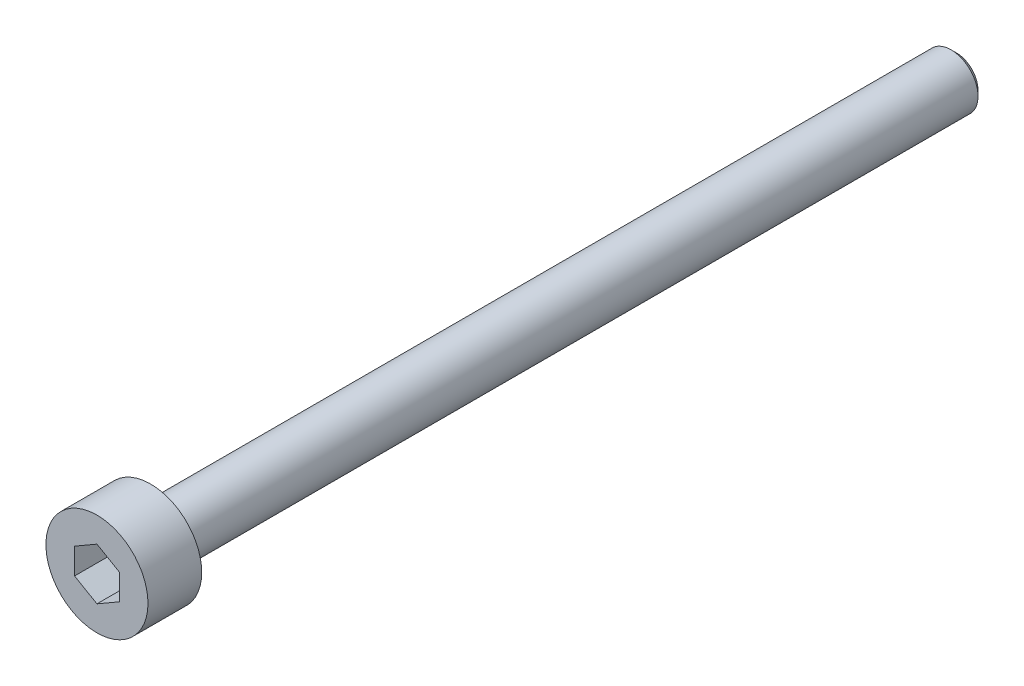
ISO-10303-21;
HEADER;
FILE_DESCRIPTION(('STEP AP214'),'2;1');
FILE_NAME('part.step','',(''),(''),'','','');
FILE_SCHEMA(('AUTOMOTIVE_DESIGN { 1 0 10303 214 1 1 1 1 }'));
ENDSEC;
DATA;
#1=APPLICATION_CONTEXT('core data for automotive mechanical design processes');
#2=APPLICATION_PROTOCOL_DEFINITION('international standard','automotive_design',2000,#1);
#3=PRODUCT_CONTEXT('',#1,'mechanical');
#4=PRODUCT('Part','Part','',(#3));
#5=PRODUCT_RELATED_PRODUCT_CATEGORY('part','',(#4));
#6=PRODUCT_DEFINITION_FORMATION('','',#4);
#7=PRODUCT_DEFINITION_CONTEXT('part definition',#1,'design');
#8=PRODUCT_DEFINITION('design','',#6,#7);
#9=PRODUCT_DEFINITION_SHAPE('','',#8);
#10=(LENGTH_UNIT() NAMED_UNIT(*) SI_UNIT(.MILLI.,.METRE.));
#11=(NAMED_UNIT(*) PLANE_ANGLE_UNIT() SI_UNIT($,.RADIAN.));
#12=(NAMED_UNIT(*) SI_UNIT($,.STERADIAN.) SOLID_ANGLE_UNIT());
#13=UNCERTAINTY_MEASURE_WITH_UNIT(LENGTH_MEASURE(1.E-05),#10,'distance_accuracy_value','');
#14=(GEOMETRIC_REPRESENTATION_CONTEXT(3) GLOBAL_UNCERTAINTY_ASSIGNED_CONTEXT((#13)) GLOBAL_UNIT_ASSIGNED_CONTEXT((#10,
#11,#12)) REPRESENTATION_CONTEXT('',''));
#15=CARTESIAN_POINT('',(0.,0.,0.));
#16=DIRECTION('',(0.,0.,1.));
#17=DIRECTION('',(1.,0.,0.));
#18=AXIS2_PLACEMENT_3D('',#15,#16,#17);
#19=CARTESIAN_POINT('',(0.,0.,0.));
#20=DIRECTION('',(0.,0.,1.));
#21=DIRECTION('',(1.,0.,0.));
#22=AXIS2_PLACEMENT_3D('',#19,#20,#21);
#23=PLANE('',#22);
#24=CARTESIAN_POINT('',(0.,0.,0.));
#25=DIRECTION('',(0.,0.,1.));
#26=DIRECTION('',(1.,0.,0.));
#27=AXIS2_PLACEMENT_3D('',#24,#25,#26);
#28=CIRCLE('',#27,2.85);
#29=CARTESIAN_POINT('',(2.85,0.,0.));
#30=VERTEX_POINT('',#29);
#31=EDGE_CURVE('E137',#30,#30,#28,.T.);
#32=ORIENTED_EDGE('',*,*,#31,.F.);
#33=EDGE_LOOP('',(#32));
#34=FACE_BOUND('',#33,.T.);
#35=CARTESIAN_POINT('',(0.,0.,0.));
#36=DIRECTION('',(0.,0.,1.));
#37=DIRECTION('',(1.,0.,0.));
#38=AXIS2_PLACEMENT_3D('',#35,#36,#37);
#39=CIRCLE('',#38,1.5);
#40=CARTESIAN_POINT('',(1.5,0.,0.));
#41=VERTEX_POINT('',#40);
#42=EDGE_CURVE('E146',#41,#41,#39,.F.);
#43=ORIENTED_EDGE('',*,*,#42,.F.);
#44=EDGE_LOOP('',(#43));
#45=FACE_BOUND('',#44,.T.);
#46=ADVANCED_FACE('F35',(#34,#45),#23,.F.);
#47=CARTESIAN_POINT('',(0.,0.,3.));
#48=DIRECTION('',(0.,0.,-1.));
#49=DIRECTION('',(-1.,0.,0.));
#50=AXIS2_PLACEMENT_3D('',#47,#48,#49);
#51=CYLINDRICAL_SURFACE('',#50,2.85);
#52=CARTESIAN_POINT('',(0.,0.,3.));
#53=DIRECTION('',(0.,0.,1.));
#54=DIRECTION('',(1.,0.,0.));
#55=AXIS2_PLACEMENT_3D('',#52,#53,#54);
#56=CIRCLE('',#55,2.85);
#57=CARTESIAN_POINT('',(2.85,0.,3.));
#58=VERTEX_POINT('',#57);
#59=EDGE_CURVE('E143',#58,#58,#56,.T.);
#60=ORIENTED_EDGE('',*,*,#59,.F.);
#61=EDGE_LOOP('',(#60));
#62=FACE_BOUND('',#61,.T.);
#63=ORIENTED_EDGE('',*,*,#31,.T.);
#64=EDGE_LOOP('',(#63));
#65=FACE_BOUND('',#64,.T.);
#66=ADVANCED_FACE('F168',(#62,#65),#51,.T.);
#67=CARTESIAN_POINT('',(0.,0.,3.));
#68=DIRECTION('',(0.,0.,1.));
#69=DIRECTION('',(1.,0.,0.));
#70=AXIS2_PLACEMENT_3D('',#67,#68,#69);
#71=PLANE('',#70);
#72=DIRECTION('',(-0.866025403784439,0.5,0.));
#73=VECTOR('',#72,1.);
#74=CARTESIAN_POINT('',(1.25,0.721687836487032,3.));
#75=LINE('',#74,#73);
#76=CARTESIAN_POINT('',(1.25,0.721687836487032,3.));
#77=VERTEX_POINT('',#76);
#78=CARTESIAN_POINT('',(0.,1.44337567297406,3.));
#79=VERTEX_POINT('',#78);
#80=EDGE_CURVE('E50',#77,#79,#75,.T.);
#81=ORIENTED_EDGE('',*,*,#80,.F.);
#82=DIRECTION('',(0.,1.,0.));
#83=VECTOR('',#82,1.);
#84=CARTESIAN_POINT('',(1.25,-0.721687836487032,3.));
#85=LINE('',#84,#83);
#86=CARTESIAN_POINT('',(1.25,-0.721687836487032,3.));
#87=VERTEX_POINT('',#86);
#88=EDGE_CURVE('E133',#87,#77,#85,.T.);
#89=ORIENTED_EDGE('',*,*,#88,.F.);
#90=DIRECTION('',(0.866025403784439,0.5,0.));
#91=VECTOR('',#90,1.);
#92=CARTESIAN_POINT('',(0.,-1.44337567297406,3.));
#93=LINE('',#92,#91);
#94=CARTESIAN_POINT('',(0.,-1.44337567297406,3.));
#95=VERTEX_POINT('',#94);
#96=EDGE_CURVE('E131',#95,#87,#93,.T.);
#97=ORIENTED_EDGE('',*,*,#96,.F.);
#98=DIRECTION('',(0.866025403784439,-0.5,0.));
#99=VECTOR('',#98,1.);
#100=CARTESIAN_POINT('',(-1.25,-0.721687836487033,3.));
#101=LINE('',#100,#99);
#102=CARTESIAN_POINT('',(-1.25,-0.721687836487033,3.));
#103=VERTEX_POINT('',#102);
#104=EDGE_CURVE('E98',#103,#95,#101,.T.);
#105=ORIENTED_EDGE('',*,*,#104,.F.);
#106=DIRECTION('',(0.,-1.,0.));
#107=VECTOR('',#106,1.);
#108=CARTESIAN_POINT('',(-1.25,0.721687836487032,3.));
#109=LINE('',#108,#107);
#110=CARTESIAN_POINT('',(-1.25,0.721687836487032,3.));
#111=VERTEX_POINT('',#110);
#112=EDGE_CURVE('E127',#111,#103,#109,.T.);
#113=ORIENTED_EDGE('',*,*,#112,.F.);
#114=DIRECTION('',(-0.866025403784439,-0.5,0.));
#115=VECTOR('',#114,1.);
#116=CARTESIAN_POINT('',(0.,1.44337567297406,3.));
#117=LINE('',#116,#115);
#118=EDGE_CURVE('E124',#79,#111,#117,.T.);
#119=ORIENTED_EDGE('',*,*,#118,.F.);
#120=EDGE_LOOP('',(#81,#89,#97,#105,#113,#119));
#121=FACE_BOUND('',#120,.T.);
#122=ORIENTED_EDGE('',*,*,#59,.T.);
#123=EDGE_LOOP('',(#122));
#124=FACE_BOUND('',#123,.T.);
#125=ADVANCED_FACE('F174',(#121,#124),#71,.T.);
#126=CARTESIAN_POINT('',(0.,0.,-45.));
#127=DIRECTION('',(0.,0.,1.));
#128=DIRECTION('',(1.,0.,0.));
#129=AXIS2_PLACEMENT_3D('',#126,#127,#128);
#130=CYLINDRICAL_SURFACE('',#129,1.5);
#131=CARTESIAN_POINT('',(0.,0.,-44.7));
#132=DIRECTION('',(0.,0.,-1.));
#133=DIRECTION('',(-1.,0.,0.));
#134=AXIS2_PLACEMENT_3D('',#131,#132,#133);
#135=CIRCLE('',#134,1.5);
#136=CARTESIAN_POINT('',(-1.5,0.,-44.7));
#137=VERTEX_POINT('',#136);
#138=EDGE_CURVE('E11',#137,#137,#135,.F.);
#139=ORIENTED_EDGE('',*,*,#138,.T.);
#140=EDGE_LOOP('',(#139));
#141=FACE_BOUND('',#140,.T.);
#142=ORIENTED_EDGE('',*,*,#42,.T.);
#143=EDGE_LOOP('',(#142));
#144=FACE_BOUND('',#143,.T.);
#145=ADVANCED_FACE('F164',(#141,#144),#130,.T.);
#146=CARTESIAN_POINT('',(0.,0.,-45.));
#147=DIRECTION('',(0.,0.,-1.));
#148=DIRECTION('',(-1.,0.,0.));
#149=AXIS2_PLACEMENT_3D('',#146,#147,#148);
#150=PLANE('',#149);
#151=CARTESIAN_POINT('',(0.,0.,-45.));
#152=DIRECTION('',(0.,0.,-1.));
#153=DIRECTION('',(-1.,0.,0.));
#154=AXIS2_PLACEMENT_3D('',#151,#152,#153);
#155=CIRCLE('',#154,1.20000000000001);
#156=CARTESIAN_POINT('',(-1.20000000000001,0.,-45.));
#157=VERTEX_POINT('',#156);
#158=EDGE_CURVE('E43',#157,#157,#155,.T.);
#159=ORIENTED_EDGE('',*,*,#158,.T.);
#160=EDGE_LOOP('',(#159));
#161=FACE_BOUND('',#160,.T.);
#162=ADVANCED_FACE('F153',(#161),#150,.T.);
#163=CARTESIAN_POINT('',(0.,0.,-45.));
#164=DIRECTION('',(0.,0.,1.));
#165=DIRECTION('',(1.,0.,0.));
#166=AXIS2_PLACEMENT_3D('',#163,#164,#165);
#167=CONICAL_SURFACE('',#166,1.20000000000001,0.785398163397447);
#168=ORIENTED_EDGE('',*,*,#138,.F.);
#169=EDGE_LOOP('',(#168));
#170=FACE_BOUND('',#169,.T.);
#171=ORIENTED_EDGE('',*,*,#158,.F.);
#172=EDGE_LOOP('',(#171));
#173=FACE_BOUND('',#172,.T.);
#174=ADVANCED_FACE('F37',(#170,#173),#167,.T.);
#175=CARTESIAN_POINT('',(1.25,0.721687836487032,1.));
#176=DIRECTION('',(0.5,0.866025403784439,0.));
#177=DIRECTION('',(-0.866025403784439,0.5,0.));
#178=AXIS2_PLACEMENT_3D('',#175,#176,#177);
#179=PLANE('',#178);
#180=ORIENTED_EDGE('',*,*,#80,.T.);
#181=DIRECTION('',(0.,0.,1.));
#182=VECTOR('',#181,1.);
#183=CARTESIAN_POINT('',(0.,1.44337567297406,1.));
#184=LINE('',#183,#182);
#185=CARTESIAN_POINT('',(0.,1.44337567297406,1.));
#186=VERTEX_POINT('',#185);
#187=EDGE_CURVE('E80',#186,#79,#184,.T.);
#188=ORIENTED_EDGE('',*,*,#187,.F.);
#189=DIRECTION('',(-0.866025403784439,0.5,0.));
#190=VECTOR('',#189,1.);
#191=CARTESIAN_POINT('',(1.25,0.721687836487032,1.));
#192=LINE('',#191,#190);
#193=CARTESIAN_POINT('',(1.25,0.721687836487032,1.));
#194=VERTEX_POINT('',#193);
#195=EDGE_CURVE('E135',#194,#186,#192,.T.);
#196=ORIENTED_EDGE('',*,*,#195,.F.);
#197=DIRECTION('',(0.,0.,1.));
#198=VECTOR('',#197,1.);
#199=CARTESIAN_POINT('',(1.25,0.721687836487032,1.));
#200=LINE('',#199,#198);
#201=EDGE_CURVE('E58',#194,#77,#200,.T.);
#202=ORIENTED_EDGE('',*,*,#201,.T.);
#203=EDGE_LOOP('',(#180,#188,#196,#202));
#204=FACE_BOUND('',#203,.T.);
#205=ADVANCED_FACE('F156',(#204),#179,.F.);
#206=CARTESIAN_POINT('',(1.25,-0.721687836487032,1.));
#207=DIRECTION('',(1.,0.,0.));
#208=DIRECTION('',(0.,1.,0.));
#209=AXIS2_PLACEMENT_3D('',#206,#207,#208);
#210=PLANE('',#209);
#211=ORIENTED_EDGE('',*,*,#88,.T.);
#212=ORIENTED_EDGE('',*,*,#201,.F.);
#213=DIRECTION('',(0.,1.,0.));
#214=VECTOR('',#213,1.);
#215=CARTESIAN_POINT('',(1.25,-0.721687836487032,1.));
#216=LINE('',#215,#214);
#217=CARTESIAN_POINT('',(1.25,-0.721687836487032,1.));
#218=VERTEX_POINT('',#217);
#219=EDGE_CURVE('E110',#218,#194,#216,.T.);
#220=ORIENTED_EDGE('',*,*,#219,.F.);
#221=DIRECTION('',(0.,0.,1.));
#222=VECTOR('',#221,1.);
#223=CARTESIAN_POINT('',(1.25,-0.721687836487032,1.));
#224=LINE('',#223,#222);
#225=EDGE_CURVE('E102',#218,#87,#224,.T.);
#226=ORIENTED_EDGE('',*,*,#225,.T.);
#227=EDGE_LOOP('',(#211,#212,#220,#226));
#228=FACE_BOUND('',#227,.T.);
#229=ADVANCED_FACE('F162',(#228),#210,.F.);
#230=CARTESIAN_POINT('',(0.,-1.44337567297406,1.));
#231=DIRECTION('',(0.5,-0.866025403784439,0.));
#232=DIRECTION('',(0.866025403784439,0.5,0.));
#233=AXIS2_PLACEMENT_3D('',#230,#231,#232);
#234=PLANE('',#233);
#235=ORIENTED_EDGE('',*,*,#96,.T.);
#236=ORIENTED_EDGE('',*,*,#225,.F.);
#237=DIRECTION('',(0.866025403784439,0.5,0.));
#238=VECTOR('',#237,1.);
#239=CARTESIAN_POINT('',(0.,-1.44337567297406,1.));
#240=LINE('',#239,#238);
#241=CARTESIAN_POINT('',(0.,-1.44337567297406,1.));
#242=VERTEX_POINT('',#241);
#243=EDGE_CURVE('E106',#242,#218,#240,.T.);
#244=ORIENTED_EDGE('',*,*,#243,.F.);
#245=DIRECTION('',(0.,0.,1.));
#246=VECTOR('',#245,1.);
#247=CARTESIAN_POINT('',(0.,-1.44337567297406,1.));
#248=LINE('',#247,#246);
#249=EDGE_CURVE('E91',#242,#95,#248,.T.);
#250=ORIENTED_EDGE('',*,*,#249,.T.);
#251=EDGE_LOOP('',(#235,#236,#244,#250));
#252=FACE_BOUND('',#251,.T.);
#253=ADVANCED_FACE('F107',(#252),#234,.F.);
#254=CARTESIAN_POINT('',(-1.25,-0.721687836487033,1.));
#255=DIRECTION('',(-0.5,-0.866025403784439,0.));
#256=DIRECTION('',(0.866025403784439,-0.5,0.));
#257=AXIS2_PLACEMENT_3D('',#254,#255,#256);
#258=PLANE('',#257);
#259=ORIENTED_EDGE('',*,*,#104,.T.);
#260=ORIENTED_EDGE('',*,*,#249,.F.);
#261=DIRECTION('',(0.866025403784439,-0.5,0.));
#262=VECTOR('',#261,1.);
#263=CARTESIAN_POINT('',(-1.25,-0.721687836487033,1.));
#264=LINE('',#263,#262);
#265=CARTESIAN_POINT('',(-1.25,-0.721687836487033,1.));
#266=VERTEX_POINT('',#265);
#267=EDGE_CURVE('E95',#266,#242,#264,.T.);
#268=ORIENTED_EDGE('',*,*,#267,.F.);
#269=DIRECTION('',(0.,0.,1.));
#270=VECTOR('',#269,1.);
#271=CARTESIAN_POINT('',(-1.25,-0.721687836487033,1.));
#272=LINE('',#271,#270);
#273=EDGE_CURVE('E103',#266,#103,#272,.T.);
#274=ORIENTED_EDGE('',*,*,#273,.T.);
#275=EDGE_LOOP('',(#259,#260,#268,#274));
#276=FACE_BOUND('',#275,.T.);
#277=ADVANCED_FACE('F93',(#276),#258,.F.);
#278=CARTESIAN_POINT('',(-1.25,0.721687836487032,1.));
#279=DIRECTION('',(-1.,0.,0.));
#280=DIRECTION('',(0.,0.,1.));
#281=AXIS2_PLACEMENT_3D('',#278,#279,#280);
#282=PLANE('',#281);
#283=ORIENTED_EDGE('',*,*,#112,.T.);
#284=ORIENTED_EDGE('',*,*,#273,.F.);
#285=DIRECTION('',(0.,-1.,0.));
#286=VECTOR('',#285,1.);
#287=CARTESIAN_POINT('',(-1.25,0.721687836487032,1.));
#288=LINE('',#287,#286);
#289=CARTESIAN_POINT('',(-1.25,0.721687836487032,1.));
#290=VERTEX_POINT('',#289);
#291=EDGE_CURVE('E116',#290,#266,#288,.T.);
#292=ORIENTED_EDGE('',*,*,#291,.F.);
#293=DIRECTION('',(0.,0.,1.));
#294=VECTOR('',#293,1.);
#295=CARTESIAN_POINT('',(-1.25,0.721687836487032,1.));
#296=LINE('',#295,#294);
#297=EDGE_CURVE('E140',#290,#111,#296,.T.);
#298=ORIENTED_EDGE('',*,*,#297,.T.);
#299=EDGE_LOOP('',(#283,#284,#292,#298));
#300=FACE_BOUND('',#299,.T.);
#301=ADVANCED_FACE('F188',(#300),#282,.F.);
#302=CARTESIAN_POINT('',(0.,1.44337567297406,1.));
#303=DIRECTION('',(-0.5,0.866025403784439,0.));
#304=DIRECTION('',(-0.866025403784439,-0.5,0.));
#305=AXIS2_PLACEMENT_3D('',#302,#303,#304);
#306=PLANE('',#305);
#307=ORIENTED_EDGE('',*,*,#118,.T.);
#308=ORIENTED_EDGE('',*,*,#297,.F.);
#309=DIRECTION('',(-0.866025403784439,-0.5,0.));
#310=VECTOR('',#309,1.);
#311=CARTESIAN_POINT('',(0.,1.44337567297406,1.));
#312=LINE('',#311,#310);
#313=EDGE_CURVE('E118',#186,#290,#312,.T.);
#314=ORIENTED_EDGE('',*,*,#313,.F.);
#315=ORIENTED_EDGE('',*,*,#187,.T.);
#316=EDGE_LOOP('',(#307,#308,#314,#315));
#317=FACE_BOUND('',#316,.T.);
#318=ADVANCED_FACE('F185',(#317),#306,.F.);
#319=CARTESIAN_POINT('',(0.,0.,1.));
#320=DIRECTION('',(0.,0.,1.));
#321=DIRECTION('',(1.,0.,0.));
#322=AXIS2_PLACEMENT_3D('',#319,#320,#321);
#323=PLANE('',#322);
#324=ORIENTED_EDGE('',*,*,#195,.T.);
#325=ORIENTED_EDGE('',*,*,#313,.T.);
#326=ORIENTED_EDGE('',*,*,#291,.T.);
#327=ORIENTED_EDGE('',*,*,#267,.T.);
#328=ORIENTED_EDGE('',*,*,#243,.T.);
#329=ORIENTED_EDGE('',*,*,#219,.T.);
#330=EDGE_LOOP('',(#324,#325,#326,#327,#328,#329));
#331=FACE_BOUND('',#330,.T.);
#332=ADVANCED_FACE('F113',(#331),#323,.T.);
#333=CLOSED_SHELL('',(#46,#66,#125,#145,#162,#174,#205,#229,#253,#277,#301,#318,#332));
#334=MANIFOLD_SOLID_BREP('B2',#333);
#335=ADVANCED_BREP_SHAPE_REPRESENTATION('',(#18,#334),#14);
#336=SHAPE_DEFINITION_REPRESENTATION(#9,#335);
ENDSEC;
END-ISO-10303-21;
